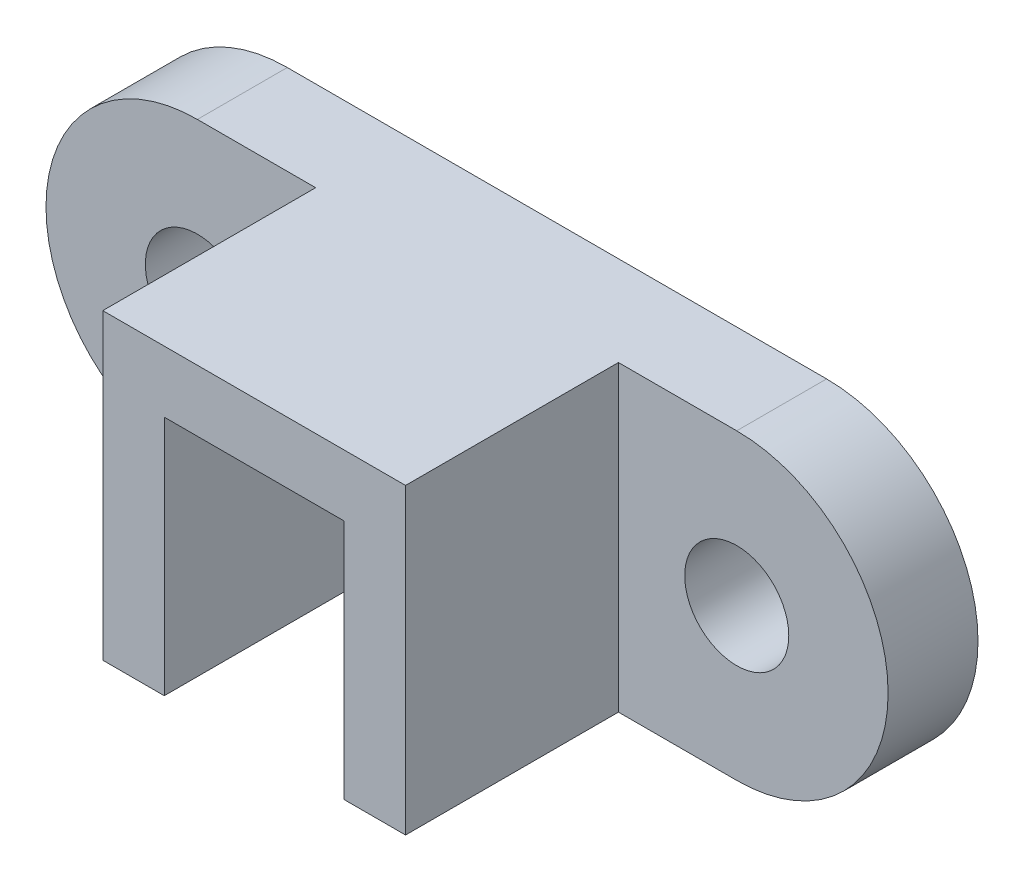
ISO-10303-21;
HEADER;
FILE_DESCRIPTION(('STEP AP214'),'2;1');
FILE_NAME('part.step','',(''),(''),'','','');
FILE_SCHEMA(('AUTOMOTIVE_DESIGN { 1 0 10303 214 1 1 1 1 }'));
ENDSEC;
DATA;
#1=APPLICATION_CONTEXT('core data for automotive mechanical design processes');
#2=APPLICATION_PROTOCOL_DEFINITION('international standard','automotive_design',2000,#1);
#3=PRODUCT_CONTEXT('',#1,'mechanical');
#4=PRODUCT('Part','Part','',(#3));
#5=PRODUCT_RELATED_PRODUCT_CATEGORY('part','',(#4));
#6=PRODUCT_DEFINITION_FORMATION('','',#4);
#7=PRODUCT_DEFINITION_CONTEXT('part definition',#1,'design');
#8=PRODUCT_DEFINITION('design','',#6,#7);
#9=PRODUCT_DEFINITION_SHAPE('','',#8);
#10=(LENGTH_UNIT() NAMED_UNIT(*) SI_UNIT(.MILLI.,.METRE.));
#11=(NAMED_UNIT(*) PLANE_ANGLE_UNIT() SI_UNIT($,.RADIAN.));
#12=(NAMED_UNIT(*) SI_UNIT($,.STERADIAN.) SOLID_ANGLE_UNIT());
#13=UNCERTAINTY_MEASURE_WITH_UNIT(LENGTH_MEASURE(1.E-05),#10,'distance_accuracy_value','');
#14=(GEOMETRIC_REPRESENTATION_CONTEXT(3) GLOBAL_UNCERTAINTY_ASSIGNED_CONTEXT((#13)) GLOBAL_UNIT_ASSIGNED_CONTEXT((#10,
#11,#12)) REPRESENTATION_CONTEXT('',''));
#15=CARTESIAN_POINT('',(0.,0.,0.));
#16=DIRECTION('',(0.,0.,1.));
#17=DIRECTION('',(1.,0.,0.));
#18=AXIS2_PLACEMENT_3D('',#15,#16,#17);
#19=CARTESIAN_POINT('',(38.,19.,19.));
#20=DIRECTION('',(-1.,0.,0.));
#21=DIRECTION('',(0.,0.,1.));
#22=AXIS2_PLACEMENT_3D('',#19,#20,#21);
#23=PLANE('',#22);
#24=DIRECTION('',(0.,-0.707106781186548,-0.707106781186547));
#25=VECTOR('',#24,1.);
#26=CARTESIAN_POINT('',(38.,19.,64.));
#27=LINE('',#26,#25);
#28=CARTESIAN_POINT('',(38.,19.,64.));
#29=VERTEX_POINT('',#28);
#30=CARTESIAN_POINT('',(38.,-32.,13.));
#31=VERTEX_POINT('',#30);
#32=EDGE_CURVE('E138',#29,#31,#27,.T.);
#33=ORIENTED_EDGE('',*,*,#32,.F.);
#34=DIRECTION('',(0.,-1.,0.));
#35=VECTOR('',#34,1.);
#36=CARTESIAN_POINT('',(38.,19.,64.));
#37=LINE('',#36,#35);
#38=CARTESIAN_POINT('',(38.,-32.,64.));
#39=VERTEX_POINT('',#38);
#40=EDGE_CURVE('E129',#29,#39,#37,.T.);
#41=ORIENTED_EDGE('',*,*,#40,.T.);
#42=DIRECTION('',(0.,0.,1.));
#43=VECTOR('',#42,1.);
#44=CARTESIAN_POINT('',(38.,-32.,19.));
#45=LINE('',#44,#43);
#46=EDGE_CURVE('E128',#31,#39,#45,.T.);
#47=ORIENTED_EDGE('',*,*,#46,.F.);
#48=EDGE_LOOP('',(#33,#41,#47));
#49=FACE_BOUND('',#48,.T.);
#50=ADVANCED_FACE('F39',(#49),#23,.F.);
#51=CARTESIAN_POINT('',(76.,-32.,19.));
#52=DIRECTION('',(1.,0.,0.));
#53=DIRECTION('',(0.,0.,-1.));
#54=AXIS2_PLACEMENT_3D('',#51,#52,#53);
#55=PLANE('',#54);
#56=DIRECTION('',(0.,-0.707106781186548,-0.707106781186547));
#57=VECTOR('',#56,1.);
#58=CARTESIAN_POINT('',(76.,19.,64.));
#59=LINE('',#58,#57);
#60=CARTESIAN_POINT('',(76.,19.,64.));
#61=VERTEX_POINT('',#60);
#62=CARTESIAN_POINT('',(76.,-32.,13.));
#63=VERTEX_POINT('',#62);
#64=EDGE_CURVE('E132',#61,#63,#59,.T.);
#65=ORIENTED_EDGE('',*,*,#64,.T.);
#66=DIRECTION('',(0.,0.,1.));
#67=VECTOR('',#66,1.);
#68=CARTESIAN_POINT('',(76.,-32.,19.));
#69=LINE('',#68,#67);
#70=CARTESIAN_POINT('',(76.,-32.,64.));
#71=VERTEX_POINT('',#70);
#72=EDGE_CURVE('E54',#63,#71,#69,.T.);
#73=ORIENTED_EDGE('',*,*,#72,.T.);
#74=DIRECTION('',(0.,1.,0.));
#75=VECTOR('',#74,1.);
#76=CARTESIAN_POINT('',(76.,-32.,64.));
#77=LINE('',#76,#75);
#78=EDGE_CURVE('E134',#71,#61,#77,.T.);
#79=ORIENTED_EDGE('',*,*,#78,.T.);
#80=EDGE_LOOP('',(#65,#73,#79));
#81=FACE_BOUND('',#80,.T.);
#82=ADVANCED_FACE('F133',(#81),#55,.F.);
#83=CARTESIAN_POINT('',(0.,0.,19.));
#84=DIRECTION('',(0.,0.,1.));
#85=DIRECTION('',(1.,0.,0.));
#86=AXIS2_PLACEMENT_3D('',#83,#84,#85);
#87=PLANE('',#86);
#88=DIRECTION('',(0.,1.,0.));
#89=VECTOR('',#88,1.);
#90=CARTESIAN_POINT('',(89.,32.,19.));
#91=LINE('',#90,#89);
#92=CARTESIAN_POINT('',(89.,-32.,19.));
#93=VERTEX_POINT('',#92);
#94=CARTESIAN_POINT('',(89.,32.,19.));
#95=VERTEX_POINT('',#94);
#96=EDGE_CURVE('E62',#93,#95,#91,.T.);
#97=ORIENTED_EDGE('',*,*,#96,.F.);
#98=DIRECTION('',(1.,0.,0.));
#99=VECTOR('',#98,1.);
#100=CARTESIAN_POINT('',(0.,-32.,19.));
#101=LINE('',#100,#99);
#102=CARTESIAN_POINT('',(114.,-32.,19.));
#103=VERTEX_POINT('',#102);
#104=EDGE_CURVE('E187',#93,#103,#101,.T.);
#105=ORIENTED_EDGE('',*,*,#104,.T.);
#106=CARTESIAN_POINT('',(114.,0.,19.));
#107=DIRECTION('',(0.,0.,1.));
#108=DIRECTION('',(1.,0.,0.));
#109=AXIS2_PLACEMENT_3D('',#106,#107,#108);
#110=CIRCLE('',#109,32.);
#111=CARTESIAN_POINT('',(114.,32.,19.));
#112=VERTEX_POINT('',#111);
#113=EDGE_CURVE('E176',#112,#103,#110,.F.);
#114=ORIENTED_EDGE('',*,*,#113,.F.);
#115=DIRECTION('',(1.,0.,0.));
#116=VECTOR('',#115,1.);
#117=CARTESIAN_POINT('',(0.,32.,19.));
#118=LINE('',#117,#116);
#119=EDGE_CURVE('E179',#95,#112,#118,.T.);
#120=ORIENTED_EDGE('',*,*,#119,.F.);
#121=EDGE_LOOP('',(#97,#105,#114,#120));
#122=FACE_BOUND('',#121,.T.);
#123=CARTESIAN_POINT('',(114.,0.,19.));
#124=DIRECTION('',(0.,0.,1.));
#125=DIRECTION('',(1.,0.,0.));
#126=AXIS2_PLACEMENT_3D('',#123,#124,#125);
#127=CIRCLE('',#126,11.);
#128=CARTESIAN_POINT('',(125.,0.,19.));
#129=VERTEX_POINT('',#128);
#130=EDGE_CURVE('E193',#129,#129,#127,.T.);
#131=ORIENTED_EDGE('',*,*,#130,.F.);
#132=EDGE_LOOP('',(#131));
#133=FACE_BOUND('',#132,.T.);
#134=ADVANCED_FACE('F248',(#122,#133),#87,.T.);
#135=CARTESIAN_POINT('',(114.,0.,19.));
#136=DIRECTION('',(0.,0.,-1.));
#137=DIRECTION('',(-1.,0.,0.));
#138=AXIS2_PLACEMENT_3D('',#135,#136,#137);
#139=CYLINDRICAL_SURFACE('',#138,32.);
#140=CARTESIAN_POINT('',(114.,0.,0.));
#141=DIRECTION('',(0.,0.,1.));
#142=DIRECTION('',(1.,0.,0.));
#143=AXIS2_PLACEMENT_3D('',#140,#141,#142);
#144=CIRCLE('',#143,32.);
#145=CARTESIAN_POINT('',(114.,32.,0.));
#146=VERTEX_POINT('',#145);
#147=CARTESIAN_POINT('',(114.,-32.,0.));
#148=VERTEX_POINT('',#147);
#149=EDGE_CURVE('E175',#146,#148,#144,.F.);
#150=ORIENTED_EDGE('',*,*,#149,.F.);
#151=DIRECTION('',(0.,0.,-1.));
#152=VECTOR('',#151,1.);
#153=CARTESIAN_POINT('',(114.,32.,19.));
#154=LINE('',#153,#152);
#155=EDGE_CURVE('E11',#112,#146,#154,.T.);
#156=ORIENTED_EDGE('',*,*,#155,.F.);
#157=ORIENTED_EDGE('',*,*,#113,.T.);
#158=DIRECTION('',(0.,0.,-1.));
#159=VECTOR('',#158,1.);
#160=CARTESIAN_POINT('',(114.,-32.,19.));
#161=LINE('',#160,#159);
#162=EDGE_CURVE('E196',#103,#148,#161,.T.);
#163=ORIENTED_EDGE('',*,*,#162,.T.);
#164=EDGE_LOOP('',(#150,#156,#157,#163));
#165=FACE_BOUND('',#164,.T.);
#166=ADVANCED_FACE('F41',(#165),#139,.T.);
#167=CARTESIAN_POINT('',(0.,32.,19.));
#168=DIRECTION('',(0.,1.,0.));
#169=DIRECTION('',(0.,0.,1.));
#170=AXIS2_PLACEMENT_3D('',#167,#168,#169);
#171=PLANE('',#170);
#172=DIRECTION('',(1.,0.,0.));
#173=VECTOR('',#172,1.);
#174=CARTESIAN_POINT('',(0.,32.,0.));
#175=LINE('',#174,#173);
#176=CARTESIAN_POINT('',(0.,32.,0.));
#177=VERTEX_POINT('',#176);
#178=EDGE_CURVE('E199',#177,#146,#175,.T.);
#179=ORIENTED_EDGE('',*,*,#178,.F.);
#180=DIRECTION('',(0.,0.,-1.));
#181=VECTOR('',#180,1.);
#182=CARTESIAN_POINT('',(0.,32.,19.));
#183=LINE('',#182,#181);
#184=CARTESIAN_POINT('',(0.,32.,19.));
#185=VERTEX_POINT('',#184);
#186=EDGE_CURVE('E47',#185,#177,#183,.T.);
#187=ORIENTED_EDGE('',*,*,#186,.F.);
#188=CARTESIAN_POINT('',(25.,32.,19.));
#189=VERTEX_POINT('',#188);
#190=EDGE_CURVE('E181',#185,#189,#118,.T.);
#191=ORIENTED_EDGE('',*,*,#190,.T.);
#192=DIRECTION('',(0.,0.,-1.));
#193=VECTOR('',#192,1.);
#194=CARTESIAN_POINT('',(25.,32.,64.));
#195=LINE('',#194,#193);
#196=CARTESIAN_POINT('',(25.,32.,64.));
#197=VERTEX_POINT('',#196);
#198=EDGE_CURVE('E169',#197,#189,#195,.T.);
#199=ORIENTED_EDGE('',*,*,#198,.F.);
#200=DIRECTION('',(-1.,0.,0.));
#201=VECTOR('',#200,1.);
#202=CARTESIAN_POINT('',(25.,32.,64.));
#203=LINE('',#202,#201);
#204=CARTESIAN_POINT('',(89.,32.,64.));
#205=VERTEX_POINT('',#204);
#206=EDGE_CURVE('E152',#205,#197,#203,.T.);
#207=ORIENTED_EDGE('',*,*,#206,.F.);
#208=DIRECTION('',(0.,0.,-1.));
#209=VECTOR('',#208,1.);
#210=CARTESIAN_POINT('',(89.,32.,64.));
#211=LINE('',#210,#209);
#212=EDGE_CURVE('E172',#205,#95,#211,.T.);
#213=ORIENTED_EDGE('',*,*,#212,.T.);
#214=ORIENTED_EDGE('',*,*,#119,.T.);
#215=ORIENTED_EDGE('',*,*,#155,.T.);
#216=EDGE_LOOP('',(#179,#187,#191,#199,#207,#213,#214,#215));
#217=FACE_BOUND('',#216,.T.);
#218=ADVANCED_FACE('F222',(#217),#171,.T.);
#219=CARTESIAN_POINT('',(0.,0.,19.));
#220=DIRECTION('',(0.,0.,-1.));
#221=DIRECTION('',(-1.,0.,0.));
#222=AXIS2_PLACEMENT_3D('',#219,#220,#221);
#223=CYLINDRICAL_SURFACE('',#222,32.);
#224=CARTESIAN_POINT('',(0.,0.,0.));
#225=DIRECTION('',(0.,0.,1.));
#226=DIRECTION('',(1.,0.,0.));
#227=AXIS2_PLACEMENT_3D('',#224,#225,#226);
#228=CIRCLE('',#227,32.);
#229=CARTESIAN_POINT('',(0.,-32.,0.));
#230=VERTEX_POINT('',#229);
#231=EDGE_CURVE('E202',#230,#177,#228,.F.);
#232=ORIENTED_EDGE('',*,*,#231,.F.);
#233=DIRECTION('',(0.,0.,-1.));
#234=VECTOR('',#233,1.);
#235=CARTESIAN_POINT('',(0.,-32.,19.));
#236=LINE('',#235,#234);
#237=CARTESIAN_POINT('',(0.,-32.,19.));
#238=VERTEX_POINT('',#237);
#239=EDGE_CURVE('E214',#238,#230,#236,.T.);
#240=ORIENTED_EDGE('',*,*,#239,.F.);
#241=CARTESIAN_POINT('',(0.,0.,19.));
#242=DIRECTION('',(0.,0.,1.));
#243=DIRECTION('',(1.,0.,0.));
#244=AXIS2_PLACEMENT_3D('',#241,#242,#243);
#245=CIRCLE('',#244,32.);
#246=EDGE_CURVE('E184',#238,#185,#245,.F.);
#247=ORIENTED_EDGE('',*,*,#246,.T.);
#248=ORIENTED_EDGE('',*,*,#186,.T.);
#249=EDGE_LOOP('',(#232,#240,#247,#248));
#250=FACE_BOUND('',#249,.T.);
#251=ADVANCED_FACE('F218',(#250),#223,.T.);
#252=CARTESIAN_POINT('',(0.,0.,19.));
#253=DIRECTION('',(0.,0.,-1.));
#254=DIRECTION('',(-1.,0.,0.));
#255=AXIS2_PLACEMENT_3D('',#252,#253,#254);
#256=CYLINDRICAL_SURFACE('',#255,11.);
#257=CARTESIAN_POINT('',(0.,0.,19.));
#258=DIRECTION('',(0.,0.,1.));
#259=DIRECTION('',(1.,0.,0.));
#260=AXIS2_PLACEMENT_3D('',#257,#258,#259);
#261=CIRCLE('',#260,11.);
#262=CARTESIAN_POINT('',(11.,0.,19.));
#263=VERTEX_POINT('',#262);
#264=EDGE_CURVE('E190',#263,#263,#261,.T.);
#265=ORIENTED_EDGE('',*,*,#264,.T.);
#266=EDGE_LOOP('',(#265));
#267=FACE_BOUND('',#266,.T.);
#268=CARTESIAN_POINT('',(0.,0.,0.));
#269=DIRECTION('',(0.,0.,1.));
#270=DIRECTION('',(1.,0.,0.));
#271=AXIS2_PLACEMENT_3D('',#268,#269,#270);
#272=CIRCLE('',#271,11.);
#273=CARTESIAN_POINT('',(11.,0.,0.));
#274=VERTEX_POINT('',#273);
#275=EDGE_CURVE('E208',#274,#274,#272,.T.);
#276=ORIENTED_EDGE('',*,*,#275,.F.);
#277=EDGE_LOOP('',(#276));
#278=FACE_BOUND('',#277,.T.);
#279=ADVANCED_FACE('F279',(#267,#278),#256,.F.);
#280=CARTESIAN_POINT('',(0.,-32.,19.));
#281=DIRECTION('',(0.,1.,0.));
#282=DIRECTION('',(0.,0.,1.));
#283=AXIS2_PLACEMENT_3D('',#280,#281,#282);
#284=PLANE('',#283);
#285=DIRECTION('',(1.,0.,0.));
#286=VECTOR('',#285,1.);
#287=CARTESIAN_POINT('',(76.,-32.,13.));
#288=LINE('',#287,#286);
#289=EDGE_CURVE('E124',#31,#63,#288,.T.);
#290=ORIENTED_EDGE('',*,*,#289,.F.);
#291=ORIENTED_EDGE('',*,*,#46,.T.);
#292=DIRECTION('',(1.,0.,0.));
#293=VECTOR('',#292,1.);
#294=CARTESIAN_POINT('',(89.,-32.,64.));
#295=LINE('',#294,#293);
#296=CARTESIAN_POINT('',(25.,-32.,64.));
#297=VERTEX_POINT('',#296);
#298=EDGE_CURVE('E157',#297,#39,#295,.T.);
#299=ORIENTED_EDGE('',*,*,#298,.F.);
#300=DIRECTION('',(0.,0.,-1.));
#301=VECTOR('',#300,1.);
#302=CARTESIAN_POINT('',(25.,-32.,64.));
#303=LINE('',#302,#301);
#304=CARTESIAN_POINT('',(25.,-32.,19.));
#305=VERTEX_POINT('',#304);
#306=EDGE_CURVE('E166',#297,#305,#303,.T.);
#307=ORIENTED_EDGE('',*,*,#306,.T.);
#308=EDGE_CURVE('E188',#238,#305,#101,.T.);
#309=ORIENTED_EDGE('',*,*,#308,.F.);
#310=ORIENTED_EDGE('',*,*,#239,.T.);
#311=DIRECTION('',(1.,0.,0.));
#312=VECTOR('',#311,1.);
#313=CARTESIAN_POINT('',(0.,-32.,0.));
#314=LINE('',#313,#312);
#315=EDGE_CURVE('E205',#230,#148,#314,.T.);
#316=ORIENTED_EDGE('',*,*,#315,.T.);
#317=ORIENTED_EDGE('',*,*,#162,.F.);
#318=ORIENTED_EDGE('',*,*,#104,.F.);
#319=DIRECTION('',(0.,0.,-1.));
#320=VECTOR('',#319,1.);
#321=CARTESIAN_POINT('',(89.,-32.,64.));
#322=LINE('',#321,#320);
#323=CARTESIAN_POINT('',(89.,-32.,64.));
#324=VERTEX_POINT('',#323);
#325=EDGE_CURVE('E160',#324,#93,#322,.T.);
#326=ORIENTED_EDGE('',*,*,#325,.F.);
#327=EDGE_CURVE('E127',#71,#324,#295,.T.);
#328=ORIENTED_EDGE('',*,*,#327,.F.);
#329=ORIENTED_EDGE('',*,*,#72,.F.);
#330=EDGE_LOOP('',(#290,#291,#299,#307,#309,#310,#316,#317,#318,#326,#328,#329));
#331=FACE_BOUND('',#330,.T.);
#332=ADVANCED_FACE('F121',(#331),#284,.F.);
#333=CARTESIAN_POINT('',(114.,0.,19.));
#334=DIRECTION('',(0.,0.,-1.));
#335=DIRECTION('',(-1.,0.,0.));
#336=AXIS2_PLACEMENT_3D('',#333,#334,#335);
#337=CYLINDRICAL_SURFACE('',#336,11.);
#338=ORIENTED_EDGE('',*,*,#130,.T.);
#339=EDGE_LOOP('',(#338));
#340=FACE_BOUND('',#339,.T.);
#341=CARTESIAN_POINT('',(114.,0.,0.));
#342=DIRECTION('',(0.,0.,1.));
#343=DIRECTION('',(1.,0.,0.));
#344=AXIS2_PLACEMENT_3D('',#341,#342,#343);
#345=CIRCLE('',#344,11.);
#346=CARTESIAN_POINT('',(125.,0.,0.));
#347=VERTEX_POINT('',#346);
#348=EDGE_CURVE('E180',#347,#347,#345,.T.);
#349=ORIENTED_EDGE('',*,*,#348,.F.);
#350=EDGE_LOOP('',(#349));
#351=FACE_BOUND('',#350,.T.);
#352=ADVANCED_FACE('F273',(#340,#351),#337,.F.);
#353=DIRECTION('',(0.,-1.,0.));
#354=VECTOR('',#353,1.);
#355=CARTESIAN_POINT('',(25.,-32.,19.));
#356=LINE('',#355,#354);
#357=EDGE_CURVE('E153',#189,#305,#356,.T.);
#358=ORIENTED_EDGE('',*,*,#357,.F.);
#359=ORIENTED_EDGE('',*,*,#190,.F.);
#360=ORIENTED_EDGE('',*,*,#246,.F.);
#361=ORIENTED_EDGE('',*,*,#308,.T.);
#362=EDGE_LOOP('',(#358,#359,#360,#361));
#363=FACE_BOUND('',#362,.T.);
#364=ORIENTED_EDGE('',*,*,#264,.F.);
#365=EDGE_LOOP('',(#364));
#366=FACE_BOUND('',#365,.T.);
#367=ADVANCED_FACE('F234',(#363,#366),#87,.T.);
#368=CARTESIAN_POINT('',(0.,0.,0.));
#369=DIRECTION('',(0.,0.,1.));
#370=DIRECTION('',(1.,0.,0.));
#371=AXIS2_PLACEMENT_3D('',#368,#369,#370);
#372=PLANE('',#371);
#373=ORIENTED_EDGE('',*,*,#149,.T.);
#374=ORIENTED_EDGE('',*,*,#315,.F.);
#375=ORIENTED_EDGE('',*,*,#231,.T.);
#376=ORIENTED_EDGE('',*,*,#178,.T.);
#377=EDGE_LOOP('',(#373,#374,#375,#376));
#378=FACE_BOUND('',#377,.T.);
#379=ORIENTED_EDGE('',*,*,#275,.T.);
#380=EDGE_LOOP('',(#379));
#381=FACE_BOUND('',#380,.T.);
#382=ORIENTED_EDGE('',*,*,#348,.T.);
#383=EDGE_LOOP('',(#382));
#384=FACE_BOUND('',#383,.T.);
#385=ADVANCED_FACE('F227',(#378,#381,#384),#372,.F.);
#386=CARTESIAN_POINT('',(89.,32.,64.));
#387=DIRECTION('',(-1.,0.,0.));
#388=DIRECTION('',(0.,-1.,0.));
#389=AXIS2_PLACEMENT_3D('',#386,#387,#388);
#390=PLANE('',#389);
#391=ORIENTED_EDGE('',*,*,#96,.T.);
#392=ORIENTED_EDGE('',*,*,#212,.F.);
#393=DIRECTION('',(0.,1.,0.));
#394=VECTOR('',#393,1.);
#395=CARTESIAN_POINT('',(89.,32.,64.));
#396=LINE('',#395,#394);
#397=EDGE_CURVE('E149',#324,#205,#396,.T.);
#398=ORIENTED_EDGE('',*,*,#397,.F.);
#399=ORIENTED_EDGE('',*,*,#325,.T.);
#400=EDGE_LOOP('',(#391,#392,#398,#399));
#401=FACE_BOUND('',#400,.T.);
#402=ADVANCED_FACE('F246',(#401),#390,.F.);
#403=CARTESIAN_POINT('',(25.,-32.,64.));
#404=DIRECTION('',(1.,0.,0.));
#405=DIRECTION('',(0.,0.,-1.));
#406=AXIS2_PLACEMENT_3D('',#403,#404,#405);
#407=PLANE('',#406);
#408=ORIENTED_EDGE('',*,*,#357,.T.);
#409=ORIENTED_EDGE('',*,*,#306,.F.);
#410=DIRECTION('',(0.,-1.,0.));
#411=VECTOR('',#410,1.);
#412=CARTESIAN_POINT('',(25.,-32.,64.));
#413=LINE('',#412,#411);
#414=EDGE_CURVE('E155',#197,#297,#413,.T.);
#415=ORIENTED_EDGE('',*,*,#414,.F.);
#416=ORIENTED_EDGE('',*,*,#198,.T.);
#417=EDGE_LOOP('',(#408,#409,#415,#416));
#418=FACE_BOUND('',#417,.T.);
#419=ADVANCED_FACE('F239',(#418),#407,.F.);
#420=CARTESIAN_POINT('',(0.,0.,64.));
#421=DIRECTION('',(0.,0.,-1.));
#422=DIRECTION('',(-1.,0.,0.));
#423=AXIS2_PLACEMENT_3D('',#420,#421,#422);
#424=PLANE('',#423);
#425=ORIENTED_EDGE('',*,*,#298,.T.);
#426=ORIENTED_EDGE('',*,*,#40,.F.);
#427=DIRECTION('',(-1.,0.,0.));
#428=VECTOR('',#427,1.);
#429=CARTESIAN_POINT('',(38.,19.,64.));
#430=LINE('',#429,#428);
#431=EDGE_CURVE('E142',#61,#29,#430,.T.);
#432=ORIENTED_EDGE('',*,*,#431,.F.);
#433=ORIENTED_EDGE('',*,*,#78,.F.);
#434=ORIENTED_EDGE('',*,*,#327,.T.);
#435=ORIENTED_EDGE('',*,*,#397,.T.);
#436=ORIENTED_EDGE('',*,*,#206,.T.);
#437=ORIENTED_EDGE('',*,*,#414,.T.);
#438=EDGE_LOOP('',(#425,#426,#432,#433,#434,#435,#436,#437));
#439=FACE_BOUND('',#438,.T.);
#440=ADVANCED_FACE('F241',(#439),#424,.F.);
#441=CARTESIAN_POINT('',(148.124891681028,19.,64.));
#442=DIRECTION('',(0.,0.707106781186547,-0.707106781186548));
#443=DIRECTION('',(0.,0.707106781186548,0.707106781186547));
#444=AXIS2_PLACEMENT_3D('',#441,#442,#443);
#445=PLANE('',#444);
#446=ORIENTED_EDGE('',*,*,#64,.F.);
#447=ORIENTED_EDGE('',*,*,#431,.T.);
#448=ORIENTED_EDGE('',*,*,#32,.T.);
#449=ORIENTED_EDGE('',*,*,#289,.T.);
#450=EDGE_LOOP('',(#446,#447,#448,#449));
#451=FACE_BOUND('',#450,.T.);
#452=ADVANCED_FACE('F140',(#451),#445,.F.);
#453=CLOSED_SHELL('',(#50,#82,#134,#166,#218,#251,#279,#332,#352,#367,#385,#402,#419,#440,#452));
#454=MANIFOLD_SOLID_BREP('B2',#453);
#455=ADVANCED_BREP_SHAPE_REPRESENTATION('',(#18,#454),#14);
#456=SHAPE_DEFINITION_REPRESENTATION(#9,#455);
ENDSEC;
END-ISO-10303-21;
